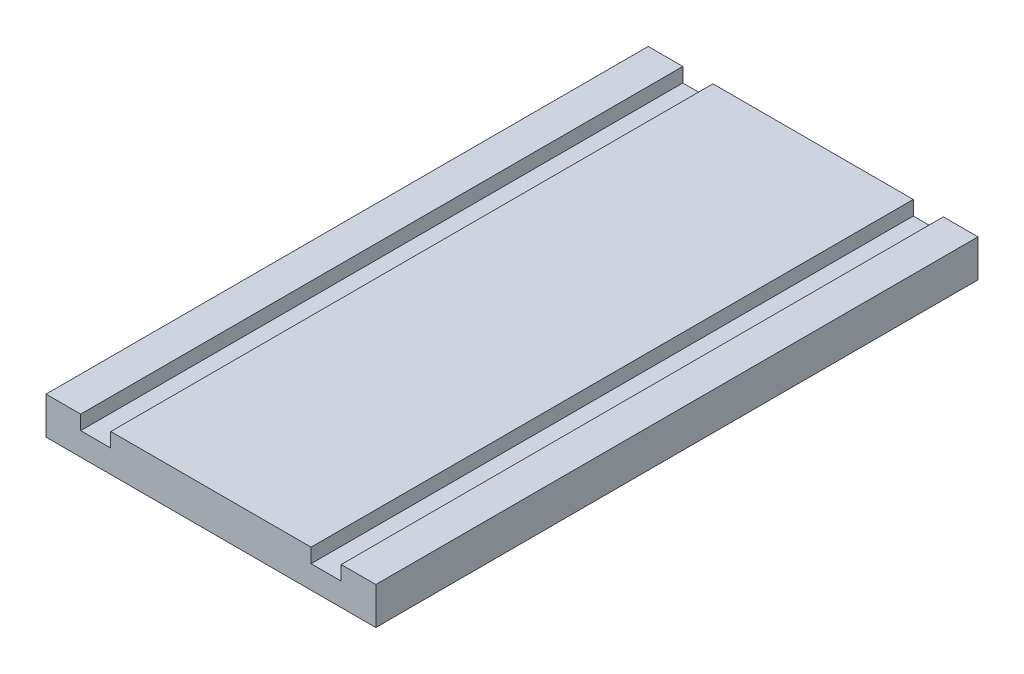
ISO-10303-21;
HEADER;
FILE_DESCRIPTION(('STEP AP214'),'2;1');
FILE_NAME('part.step','',(''),(''),'','','');
FILE_SCHEMA(('AUTOMOTIVE_DESIGN { 1 0 10303 214 1 1 1 1 }'));
ENDSEC;
DATA;
#1=APPLICATION_CONTEXT('core data for automotive mechanical design processes');
#2=APPLICATION_PROTOCOL_DEFINITION('international standard','automotive_design',2000,#1);
#3=PRODUCT_CONTEXT('',#1,'mechanical');
#4=PRODUCT('Part','Part','',(#3));
#5=PRODUCT_RELATED_PRODUCT_CATEGORY('part','',(#4));
#6=PRODUCT_DEFINITION_FORMATION('','',#4);
#7=PRODUCT_DEFINITION_CONTEXT('part definition',#1,'design');
#8=PRODUCT_DEFINITION('design','',#6,#7);
#9=PRODUCT_DEFINITION_SHAPE('','',#8);
#10=(LENGTH_UNIT() NAMED_UNIT(*) SI_UNIT(.MILLI.,.METRE.));
#11=(NAMED_UNIT(*) PLANE_ANGLE_UNIT() SI_UNIT($,.RADIAN.));
#12=(NAMED_UNIT(*) SI_UNIT($,.STERADIAN.) SOLID_ANGLE_UNIT());
#13=UNCERTAINTY_MEASURE_WITH_UNIT(LENGTH_MEASURE(1.E-05),#10,'distance_accuracy_value','');
#14=(GEOMETRIC_REPRESENTATION_CONTEXT(3) GLOBAL_UNCERTAINTY_ASSIGNED_CONTEXT((#13)) GLOBAL_UNIT_ASSIGNED_CONTEXT((#10,
#11,#12)) REPRESENTATION_CONTEXT('',''));
#15=CARTESIAN_POINT('',(0.,0.,0.));
#16=DIRECTION('',(0.,0.,1.));
#17=DIRECTION('',(1.,0.,0.));
#18=AXIS2_PLACEMENT_3D('',#15,#16,#17);
#19=CARTESIAN_POINT('',(0.,26.,0.));
#20=DIRECTION('',(0.,1.,0.));
#21=DIRECTION('',(0.,0.,1.));
#22=AXIS2_PLACEMENT_3D('',#19,#20,#21);
#23=PLANE('',#22);
#24=DIRECTION('',(0.,0.,1.));
#25=VECTOR('',#24,1.);
#26=CARTESIAN_POINT('',(-90.85,26.,-210.));
#27=LINE('',#26,#25);
#28=CARTESIAN_POINT('',(-90.85,26.,-210.));
#29=VERTEX_POINT('',#28);
#30=CARTESIAN_POINT('',(-90.85,26.,210.));
#31=VERTEX_POINT('',#30);
#32=EDGE_CURVE('E129',#29,#31,#27,.T.);
#33=ORIENTED_EDGE('',*,*,#32,.F.);
#34=DIRECTION('',(-1.,0.,0.));
#35=VECTOR('',#34,1.);
#36=CARTESIAN_POINT('',(115.,26.,-210.));
#37=LINE('',#36,#35);
#38=CARTESIAN_POINT('',(-115.,26.,-210.));
#39=VERTEX_POINT('',#38);
#40=EDGE_CURVE('E195',#29,#39,#37,.T.);
#41=ORIENTED_EDGE('',*,*,#40,.T.);
#42=DIRECTION('',(0.,0.,1.));
#43=VECTOR('',#42,1.);
#44=CARTESIAN_POINT('',(-115.,26.,210.));
#45=LINE('',#44,#43);
#46=CARTESIAN_POINT('',(-115.,26.,210.));
#47=VERTEX_POINT('',#46);
#48=EDGE_CURVE('E185',#39,#47,#45,.T.);
#49=ORIENTED_EDGE('',*,*,#48,.T.);
#50=DIRECTION('',(1.,0.,0.));
#51=VECTOR('',#50,1.);
#52=CARTESIAN_POINT('',(115.,26.,210.));
#53=LINE('',#52,#51);
#54=EDGE_CURVE('E190',#47,#31,#53,.T.);
#55=ORIENTED_EDGE('',*,*,#54,.T.);
#56=EDGE_LOOP('',(#33,#41,#49,#55));
#57=FACE_BOUND('',#56,.T.);
#58=ADVANCED_FACE('F35',(#57),#23,.T.);
#59=DIRECTION('',(0.,0.,-1.));
#60=VECTOR('',#59,1.);
#61=CARTESIAN_POINT('',(-69.85,26.,-210.));
#62=LINE('',#61,#60);
#63=CARTESIAN_POINT('',(-69.85,26.,210.));
#64=VERTEX_POINT('',#63);
#65=CARTESIAN_POINT('',(-69.85,26.,-210.));
#66=VERTEX_POINT('',#65);
#67=EDGE_CURVE('E142',#64,#66,#62,.T.);
#68=ORIENTED_EDGE('',*,*,#67,.F.);
#69=CARTESIAN_POINT('',(69.85,26.,210.));
#70=VERTEX_POINT('',#69);
#71=EDGE_CURVE('E193',#64,#70,#53,.T.);
#72=ORIENTED_EDGE('',*,*,#71,.T.);
#73=DIRECTION('',(0.,0.,1.));
#74=VECTOR('',#73,1.);
#75=CARTESIAN_POINT('',(69.85,26.,-210.));
#76=LINE('',#75,#74);
#77=CARTESIAN_POINT('',(69.85,26.,-210.));
#78=VERTEX_POINT('',#77);
#79=EDGE_CURVE('E175',#78,#70,#76,.T.);
#80=ORIENTED_EDGE('',*,*,#79,.F.);
#81=EDGE_CURVE('E200',#78,#66,#37,.T.);
#82=ORIENTED_EDGE('',*,*,#81,.T.);
#83=EDGE_LOOP('',(#68,#72,#80,#82));
#84=FACE_BOUND('',#83,.T.);
#85=ADVANCED_FACE('F237',(#84),#23,.T.);
#86=CARTESIAN_POINT('',(-115.,26.,210.));
#87=DIRECTION('',(1.,0.,0.));
#88=DIRECTION('',(0.,0.,-1.));
#89=AXIS2_PLACEMENT_3D('',#86,#87,#88);
#90=PLANE('',#89);
#91=DIRECTION('',(0.,0.,1.));
#92=VECTOR('',#91,1.);
#93=CARTESIAN_POINT('',(-115.,0.,210.));
#94=LINE('',#93,#92);
#95=CARTESIAN_POINT('',(-115.,0.,-210.));
#96=VERTEX_POINT('',#95);
#97=CARTESIAN_POINT('',(-115.,0.,210.));
#98=VERTEX_POINT('',#97);
#99=EDGE_CURVE('E156',#96,#98,#94,.T.);
#100=ORIENTED_EDGE('',*,*,#99,.T.);
#101=DIRECTION('',(0.,-1.,0.));
#102=VECTOR('',#101,1.);
#103=CARTESIAN_POINT('',(-115.,26.,210.));
#104=LINE('',#103,#102);
#105=EDGE_CURVE('E11',#47,#98,#104,.T.);
#106=ORIENTED_EDGE('',*,*,#105,.F.);
#107=ORIENTED_EDGE('',*,*,#48,.F.);
#108=DIRECTION('',(0.,-1.,0.));
#109=VECTOR('',#108,1.);
#110=CARTESIAN_POINT('',(-115.,26.,-210.));
#111=LINE('',#110,#109);
#112=EDGE_CURVE('E199',#39,#96,#111,.T.);
#113=ORIENTED_EDGE('',*,*,#112,.T.);
#114=EDGE_LOOP('',(#100,#106,#107,#113));
#115=FACE_BOUND('',#114,.T.);
#116=ADVANCED_FACE('F37',(#115),#90,.F.);
#117=CARTESIAN_POINT('',(115.,26.,210.));
#118=DIRECTION('',(0.,0.,-1.));
#119=DIRECTION('',(-1.,0.,0.));
#120=AXIS2_PLACEMENT_3D('',#117,#118,#119);
#121=PLANE('',#120);
#122=DIRECTION('',(1.,0.,0.));
#123=VECTOR('',#122,1.);
#124=CARTESIAN_POINT('',(-69.85,16.,210.));
#125=LINE('',#124,#123);
#126=CARTESIAN_POINT('',(-90.85,16.,210.));
#127=VERTEX_POINT('',#126);
#128=CARTESIAN_POINT('',(-69.85,16.,210.));
#129=VERTEX_POINT('',#128);
#130=EDGE_CURVE('E139',#127,#129,#125,.T.);
#131=ORIENTED_EDGE('',*,*,#130,.F.);
#132=DIRECTION('',(0.,1.,0.));
#133=VECTOR('',#132,1.);
#134=CARTESIAN_POINT('',(-90.85,16.,210.));
#135=LINE('',#134,#133);
#136=EDGE_CURVE('E123',#127,#31,#135,.T.);
#137=ORIENTED_EDGE('',*,*,#136,.T.);
#138=ORIENTED_EDGE('',*,*,#54,.F.);
#139=ORIENTED_EDGE('',*,*,#105,.T.);
#140=DIRECTION('',(1.,0.,0.));
#141=VECTOR('',#140,1.);
#142=CARTESIAN_POINT('',(115.,0.,210.));
#143=LINE('',#142,#141);
#144=CARTESIAN_POINT('',(115.,0.,210.));
#145=VERTEX_POINT('',#144);
#146=EDGE_CURVE('E203',#98,#145,#143,.T.);
#147=ORIENTED_EDGE('',*,*,#146,.T.);
#148=DIRECTION('',(0.,-1.,0.));
#149=VECTOR('',#148,1.);
#150=CARTESIAN_POINT('',(115.,26.,210.));
#151=LINE('',#150,#149);
#152=CARTESIAN_POINT('',(115.,26.,210.));
#153=VERTEX_POINT('',#152);
#154=EDGE_CURVE('E43',#153,#145,#151,.T.);
#155=ORIENTED_EDGE('',*,*,#154,.F.);
#156=CARTESIAN_POINT('',(90.85,26.,210.));
#157=VERTEX_POINT('',#156);
#158=EDGE_CURVE('E188',#157,#153,#53,.T.);
#159=ORIENTED_EDGE('',*,*,#158,.F.);
#160=DIRECTION('',(0.,1.,0.));
#161=VECTOR('',#160,1.);
#162=CARTESIAN_POINT('',(90.85,16.,210.));
#163=LINE('',#162,#161);
#164=CARTESIAN_POINT('',(90.85,16.,210.));
#165=VERTEX_POINT('',#164);
#166=EDGE_CURVE('E50',#165,#157,#163,.T.);
#167=ORIENTED_EDGE('',*,*,#166,.F.);
#168=DIRECTION('',(1.,0.,0.));
#169=VECTOR('',#168,1.);
#170=CARTESIAN_POINT('',(69.85,16.,210.));
#171=LINE('',#170,#169);
#172=CARTESIAN_POINT('',(69.85,16.,210.));
#173=VERTEX_POINT('',#172);
#174=EDGE_CURVE('E164',#173,#165,#171,.T.);
#175=ORIENTED_EDGE('',*,*,#174,.F.);
#176=DIRECTION('',(0.,1.,0.));
#177=VECTOR('',#176,1.);
#178=CARTESIAN_POINT('',(69.85,16.,210.));
#179=LINE('',#178,#177);
#180=EDGE_CURVE('E174',#173,#70,#179,.T.);
#181=ORIENTED_EDGE('',*,*,#180,.T.);
#182=ORIENTED_EDGE('',*,*,#71,.F.);
#183=DIRECTION('',(0.,1.,0.));
#184=VECTOR('',#183,1.);
#185=CARTESIAN_POINT('',(-69.85,16.,210.));
#186=LINE('',#185,#184);
#187=EDGE_CURVE('E58',#129,#64,#186,.T.);
#188=ORIENTED_EDGE('',*,*,#187,.F.);
#189=EDGE_LOOP('',(#131,#137,#138,#139,#147,#155,#159,#167,#175,#181,#182,#188));
#190=FACE_BOUND('',#189,.T.);
#191=ADVANCED_FACE('F144',(#190),#121,.F.);
#192=CARTESIAN_POINT('',(115.,26.,210.));
#193=DIRECTION('',(-1.,0.,0.));
#194=DIRECTION('',(0.,0.,1.));
#195=AXIS2_PLACEMENT_3D('',#192,#193,#194);
#196=PLANE('',#195);
#197=DIRECTION('',(0.,0.,-1.));
#198=VECTOR('',#197,1.);
#199=CARTESIAN_POINT('',(115.,0.,210.));
#200=LINE('',#199,#198);
#201=CARTESIAN_POINT('',(115.,0.,-210.));
#202=VERTEX_POINT('',#201);
#203=EDGE_CURVE('E205',#145,#202,#200,.T.);
#204=ORIENTED_EDGE('',*,*,#203,.T.);
#205=DIRECTION('',(0.,-1.,0.));
#206=VECTOR('',#205,1.);
#207=CARTESIAN_POINT('',(115.,26.,-210.));
#208=LINE('',#207,#206);
#209=CARTESIAN_POINT('',(115.,26.,-210.));
#210=VERTEX_POINT('',#209);
#211=EDGE_CURVE('E210',#210,#202,#208,.T.);
#212=ORIENTED_EDGE('',*,*,#211,.F.);
#213=DIRECTION('',(0.,0.,-1.));
#214=VECTOR('',#213,1.);
#215=CARTESIAN_POINT('',(115.,26.,210.));
#216=LINE('',#215,#214);
#217=EDGE_CURVE('E192',#153,#210,#216,.T.);
#218=ORIENTED_EDGE('',*,*,#217,.F.);
#219=ORIENTED_EDGE('',*,*,#154,.T.);
#220=EDGE_LOOP('',(#204,#212,#218,#219));
#221=FACE_BOUND('',#220,.T.);
#222=ADVANCED_FACE('F217',(#221),#196,.F.);
#223=CARTESIAN_POINT('',(115.,26.,-210.));
#224=DIRECTION('',(0.,0.,1.));
#225=DIRECTION('',(1.,0.,0.));
#226=AXIS2_PLACEMENT_3D('',#223,#224,#225);
#227=PLANE('',#226);
#228=ORIENTED_EDGE('',*,*,#40,.F.);
#229=DIRECTION('',(0.,1.,0.));
#230=VECTOR('',#229,1.);
#231=CARTESIAN_POINT('',(-90.85,16.,-210.));
#232=LINE('',#231,#230);
#233=CARTESIAN_POINT('',(-90.85,16.,-210.));
#234=VERTEX_POINT('',#233);
#235=EDGE_CURVE('E154',#234,#29,#232,.T.);
#236=ORIENTED_EDGE('',*,*,#235,.F.);
#237=DIRECTION('',(-1.,0.,0.));
#238=VECTOR('',#237,1.);
#239=CARTESIAN_POINT('',(-69.85,16.,-210.));
#240=LINE('',#239,#238);
#241=CARTESIAN_POINT('',(-69.85,16.,-210.));
#242=VERTEX_POINT('',#241);
#243=EDGE_CURVE('E133',#242,#234,#240,.T.);
#244=ORIENTED_EDGE('',*,*,#243,.F.);
#245=DIRECTION('',(0.,1.,0.));
#246=VECTOR('',#245,1.);
#247=CARTESIAN_POINT('',(-69.85,16.,-210.));
#248=LINE('',#247,#246);
#249=EDGE_CURVE('E157',#242,#66,#248,.T.);
#250=ORIENTED_EDGE('',*,*,#249,.T.);
#251=ORIENTED_EDGE('',*,*,#81,.F.);
#252=DIRECTION('',(0.,1.,0.));
#253=VECTOR('',#252,1.);
#254=CARTESIAN_POINT('',(69.85,16.,-210.));
#255=LINE('',#254,#253);
#256=CARTESIAN_POINT('',(69.85,16.,-210.));
#257=VERTEX_POINT('',#256);
#258=EDGE_CURVE('E152',#257,#78,#255,.T.);
#259=ORIENTED_EDGE('',*,*,#258,.F.);
#260=DIRECTION('',(-1.,0.,0.));
#261=VECTOR('',#260,1.);
#262=CARTESIAN_POINT('',(69.85,16.,-210.));
#263=LINE('',#262,#261);
#264=CARTESIAN_POINT('',(90.85,16.,-210.));
#265=VERTEX_POINT('',#264);
#266=EDGE_CURVE('E171',#265,#257,#263,.T.);
#267=ORIENTED_EDGE('',*,*,#266,.F.);
#268=DIRECTION('',(0.,1.,0.));
#269=VECTOR('',#268,1.);
#270=CARTESIAN_POINT('',(90.85,16.,-210.));
#271=LINE('',#270,#269);
#272=CARTESIAN_POINT('',(90.85,26.,-210.));
#273=VERTEX_POINT('',#272);
#274=EDGE_CURVE('E179',#265,#273,#271,.T.);
#275=ORIENTED_EDGE('',*,*,#274,.T.);
#276=EDGE_CURVE('E196',#210,#273,#37,.T.);
#277=ORIENTED_EDGE('',*,*,#276,.F.);
#278=ORIENTED_EDGE('',*,*,#211,.T.);
#279=DIRECTION('',(-1.,0.,0.));
#280=VECTOR('',#279,1.);
#281=CARTESIAN_POINT('',(115.,0.,-210.));
#282=LINE('',#281,#280);
#283=EDGE_CURVE('E189',#202,#96,#282,.T.);
#284=ORIENTED_EDGE('',*,*,#283,.T.);
#285=ORIENTED_EDGE('',*,*,#112,.F.);
#286=EDGE_LOOP('',(#228,#236,#244,#250,#251,#259,#267,#275,#277,#278,#284,#285));
#287=FACE_BOUND('',#286,.T.);
#288=ADVANCED_FACE('F227',(#287),#227,.F.);
#289=DIRECTION('',(0.,0.,-1.));
#290=VECTOR('',#289,1.);
#291=CARTESIAN_POINT('',(90.85,26.,-210.));
#292=LINE('',#291,#290);
#293=EDGE_CURVE('E165',#157,#273,#292,.T.);
#294=ORIENTED_EDGE('',*,*,#293,.F.);
#295=ORIENTED_EDGE('',*,*,#158,.T.);
#296=ORIENTED_EDGE('',*,*,#217,.T.);
#297=ORIENTED_EDGE('',*,*,#276,.T.);
#298=EDGE_LOOP('',(#294,#295,#296,#297));
#299=FACE_BOUND('',#298,.T.);
#300=ADVANCED_FACE('F253',(#299),#23,.T.);
#301=CARTESIAN_POINT('',(0.,0.,0.));
#302=DIRECTION('',(0.,1.,0.));
#303=DIRECTION('',(0.,0.,1.));
#304=AXIS2_PLACEMENT_3D('',#301,#302,#303);
#305=PLANE('',#304);
#306=ORIENTED_EDGE('',*,*,#99,.F.);
#307=ORIENTED_EDGE('',*,*,#283,.F.);
#308=ORIENTED_EDGE('',*,*,#203,.F.);
#309=ORIENTED_EDGE('',*,*,#146,.F.);
#310=EDGE_LOOP('',(#306,#307,#308,#309));
#311=FACE_BOUND('',#310,.T.);
#312=ADVANCED_FACE('F223',(#311),#305,.F.);
#313=CARTESIAN_POINT('',(69.85,16.,-210.));
#314=DIRECTION('',(-1.,0.,0.));
#315=DIRECTION('',(0.,0.,1.));
#316=AXIS2_PLACEMENT_3D('',#313,#314,#315);
#317=PLANE('',#316);
#318=ORIENTED_EDGE('',*,*,#79,.T.);
#319=ORIENTED_EDGE('',*,*,#180,.F.);
#320=DIRECTION('',(0.,0.,1.));
#321=VECTOR('',#320,1.);
#322=CARTESIAN_POINT('',(69.85,16.,-210.));
#323=LINE('',#322,#321);
#324=EDGE_CURVE('E161',#257,#173,#323,.T.);
#325=ORIENTED_EDGE('',*,*,#324,.F.);
#326=ORIENTED_EDGE('',*,*,#258,.T.);
#327=EDGE_LOOP('',(#318,#319,#325,#326));
#328=FACE_BOUND('',#327,.T.);
#329=ADVANCED_FACE('F265',(#328),#317,.F.);
#330=CARTESIAN_POINT('',(90.85,16.,-210.));
#331=DIRECTION('',(1.,0.,0.));
#332=DIRECTION('',(0.,0.,-1.));
#333=AXIS2_PLACEMENT_3D('',#330,#331,#332);
#334=PLANE('',#333);
#335=ORIENTED_EDGE('',*,*,#293,.T.);
#336=ORIENTED_EDGE('',*,*,#274,.F.);
#337=DIRECTION('',(0.,0.,-1.));
#338=VECTOR('',#337,1.);
#339=CARTESIAN_POINT('',(90.85,16.,-210.));
#340=LINE('',#339,#338);
#341=EDGE_CURVE('E168',#165,#265,#340,.T.);
#342=ORIENTED_EDGE('',*,*,#341,.F.);
#343=ORIENTED_EDGE('',*,*,#166,.T.);
#344=EDGE_LOOP('',(#335,#336,#342,#343));
#345=FACE_BOUND('',#344,.T.);
#346=ADVANCED_FACE('F270',(#345),#334,.F.);
#347=CARTESIAN_POINT('',(0.,16.,0.));
#348=DIRECTION('',(0.,1.,0.));
#349=DIRECTION('',(0.,0.,1.));
#350=AXIS2_PLACEMENT_3D('',#347,#348,#349);
#351=PLANE('',#350);
#352=ORIENTED_EDGE('',*,*,#324,.T.);
#353=ORIENTED_EDGE('',*,*,#174,.T.);
#354=ORIENTED_EDGE('',*,*,#341,.T.);
#355=ORIENTED_EDGE('',*,*,#266,.T.);
#356=EDGE_LOOP('',(#352,#353,#354,#355));
#357=FACE_BOUND('',#356,.T.);
#358=ADVANCED_FACE('F249',(#357),#351,.T.);
#359=CARTESIAN_POINT('',(-90.85,16.,-210.));
#360=DIRECTION('',(-1.,0.,0.));
#361=DIRECTION('',(0.,0.,1.));
#362=AXIS2_PLACEMENT_3D('',#359,#360,#361);
#363=PLANE('',#362);
#364=ORIENTED_EDGE('',*,*,#32,.T.);
#365=ORIENTED_EDGE('',*,*,#136,.F.);
#366=DIRECTION('',(0.,0.,1.));
#367=VECTOR('',#366,1.);
#368=CARTESIAN_POINT('',(-90.85,16.,-210.));
#369=LINE('',#368,#367);
#370=EDGE_CURVE('E126',#234,#127,#369,.T.);
#371=ORIENTED_EDGE('',*,*,#370,.F.);
#372=ORIENTED_EDGE('',*,*,#235,.T.);
#373=EDGE_LOOP('',(#364,#365,#371,#372));
#374=FACE_BOUND('',#373,.T.);
#375=ADVANCED_FACE('F125',(#374),#363,.F.);
#376=CARTESIAN_POINT('',(-69.85,16.,-210.));
#377=DIRECTION('',(1.,0.,0.));
#378=DIRECTION('',(0.,0.,-1.));
#379=AXIS2_PLACEMENT_3D('',#376,#377,#378);
#380=PLANE('',#379);
#381=ORIENTED_EDGE('',*,*,#67,.T.);
#382=ORIENTED_EDGE('',*,*,#249,.F.);
#383=DIRECTION('',(0.,0.,-1.));
#384=VECTOR('',#383,1.);
#385=CARTESIAN_POINT('',(-69.85,16.,-210.));
#386=LINE('',#385,#384);
#387=EDGE_CURVE('E146',#129,#242,#386,.T.);
#388=ORIENTED_EDGE('',*,*,#387,.F.);
#389=ORIENTED_EDGE('',*,*,#187,.T.);
#390=EDGE_LOOP('',(#381,#382,#388,#389));
#391=FACE_BOUND('',#390,.T.);
#392=ADVANCED_FACE('F241',(#391),#380,.F.);
#393=CARTESIAN_POINT('',(0.,16.,0.));
#394=DIRECTION('',(0.,-1.,0.));
#395=DIRECTION('',(0.,0.,-1.));
#396=AXIS2_PLACEMENT_3D('',#393,#394,#395);
#397=PLANE('',#396);
#398=ORIENTED_EDGE('',*,*,#370,.T.);
#399=ORIENTED_EDGE('',*,*,#130,.T.);
#400=ORIENTED_EDGE('',*,*,#387,.T.);
#401=ORIENTED_EDGE('',*,*,#243,.T.);
#402=EDGE_LOOP('',(#398,#399,#400,#401));
#403=FACE_BOUND('',#402,.T.);
#404=ADVANCED_FACE('F137',(#403),#397,.F.);
#405=CLOSED_SHELL('',(#58,#85,#116,#191,#222,#288,#300,#312,#329,#346,#358,#375,#392,#404));
#406=MANIFOLD_SOLID_BREP('B2',#405);
#407=ADVANCED_BREP_SHAPE_REPRESENTATION('',(#18,#406),#14);
#408=SHAPE_DEFINITION_REPRESENTATION(#9,#407);
ENDSEC;
END-ISO-10303-21;
